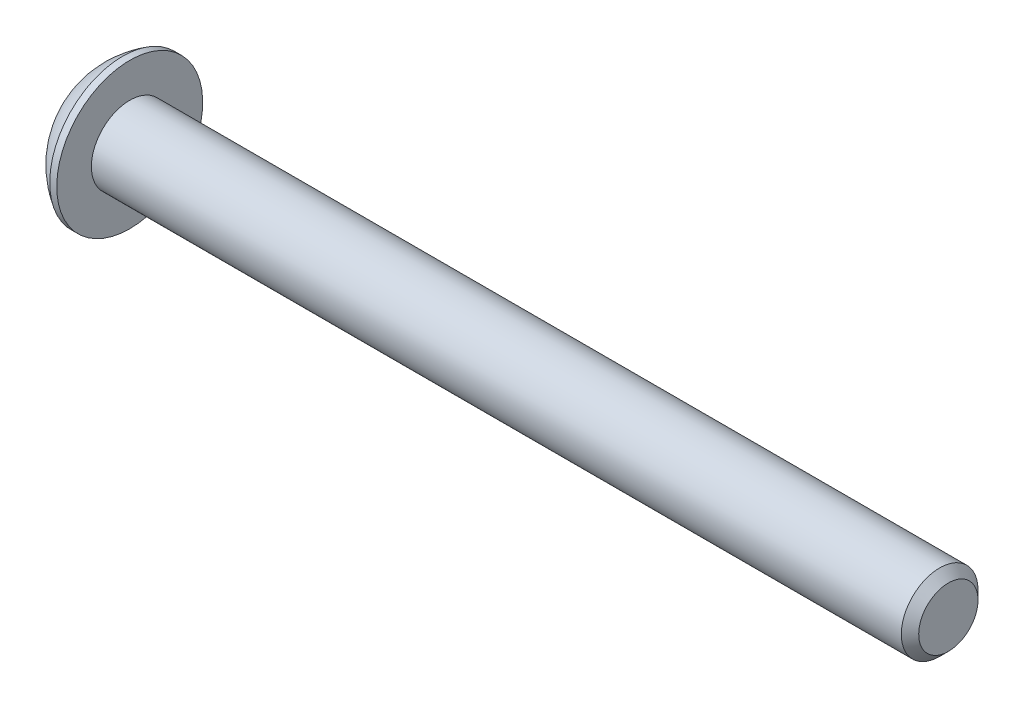
ISO-10303-21;
HEADER;
FILE_DESCRIPTION(('STEP AP214'),'2;1');
FILE_NAME('part.step','',(''),(''),'','','');
FILE_SCHEMA(('AUTOMOTIVE_DESIGN { 1 0 10303 214 1 1 1 1 }'));
ENDSEC;
DATA;
#1=APPLICATION_CONTEXT('core data for automotive mechanical design processes');
#2=APPLICATION_PROTOCOL_DEFINITION('international standard','automotive_design',2000,#1);
#3=PRODUCT_CONTEXT('',#1,'mechanical');
#4=PRODUCT('Part','Part','',(#3));
#5=PRODUCT_RELATED_PRODUCT_CATEGORY('part','',(#4));
#6=PRODUCT_DEFINITION_FORMATION('','',#4);
#7=PRODUCT_DEFINITION_CONTEXT('part definition',#1,'design');
#8=PRODUCT_DEFINITION('design','',#6,#7);
#9=PRODUCT_DEFINITION_SHAPE('','',#8);
#10=(LENGTH_UNIT() NAMED_UNIT(*) SI_UNIT(.MILLI.,.METRE.));
#11=(NAMED_UNIT(*) PLANE_ANGLE_UNIT() SI_UNIT($,.RADIAN.));
#12=(NAMED_UNIT(*) SI_UNIT($,.STERADIAN.) SOLID_ANGLE_UNIT());
#13=UNCERTAINTY_MEASURE_WITH_UNIT(LENGTH_MEASURE(1.E-05),#10,'distance_accuracy_value','');
#14=(GEOMETRIC_REPRESENTATION_CONTEXT(3) GLOBAL_UNCERTAINTY_ASSIGNED_CONTEXT((#13)) GLOBAL_UNIT_ASSIGNED_CONTEXT((#10,
#11,#12)) REPRESENTATION_CONTEXT('',''));
#15=CARTESIAN_POINT('',(0.,0.,0.));
#16=DIRECTION('',(0.,0.,1.));
#17=DIRECTION('',(1.,0.,0.));
#18=AXIS2_PLACEMENT_3D('',#15,#16,#17);
#19=CARTESIAN_POINT('',(1.32080000000623,1.51854885817992E-13,1.17961196366423E-13));
#20=DIRECTION('',(-1.,0.,0.));
#21=DIRECTION('',(0.,-1.,0.));
#22=AXIS2_PLACEMENT_3D('',#19,#20,#21);
#23=CONICAL_SURFACE('',#22,1.19380000000346,1.04719755119619);
#24=CARTESIAN_POINT('',(2.01004075136707,1.52655665886015E-13,6.66133814775094E-13));
#25=VERTEX_POINT('',#24);
#26=VERTEX_LOOP('',#25);
#27=FACE_BOUND('',#26,.T.);
#28=CARTESIAN_POINT('',(1.32080000000623,1.51854885817992E-13,1.17961196366423E-13));
#29=DIRECTION('',(-1.,0.,0.));
#30=DIRECTION('',(0.,-1.,0.));
#31=AXIS2_PLACEMENT_3D('',#28,#29,#30);
#32=CIRCLE('',#31,1.19380000000346);
#33=CARTESIAN_POINT('',(1.32080000000314,-1.03386112703932,0.596900000000856));
#34=VERTEX_POINT('',#33);
#35=CARTESIAN_POINT('',(1.32080000000313,1.62736157638526E-13,1.19380000000181));
#36=VERTEX_POINT('',#35);
#37=EDGE_CURVE('E20',#34,#36,#32,.T.);
#38=ORIENTED_EDGE('',*,*,#37,.T.);
#39=CARTESIAN_POINT('',(1.32080000000623,1.51854885817992E-13,1.17961196366423E-13));
#40=DIRECTION('',(-1.,0.,0.));
#41=DIRECTION('',(0.,-1.,0.));
#42=AXIS2_PLACEMENT_3D('',#39,#40,#41);
#43=CIRCLE('',#42,1.19380000000346);
#44=CARTESIAN_POINT('',(1.32080000000312,1.03386112703943,0.596900000001005));
#45=VERTEX_POINT('',#44);
#46=EDGE_CURVE('E148',#36,#45,#43,.T.);
#47=ORIENTED_EDGE('',*,*,#46,.T.);
#48=CARTESIAN_POINT('',(1.32080000000623,1.51854885817992E-13,1.17961196366423E-13));
#49=DIRECTION('',(-1.,0.,0.));
#50=DIRECTION('',(0.,-1.,0.));
#51=AXIS2_PLACEMENT_3D('',#48,#49,#50);
#52=CIRCLE('',#51,1.19380000000346);
#53=CARTESIAN_POINT('',(1.32080000000312,1.03386112703949,-0.596900000000715));
#54=VERTEX_POINT('',#53);
#55=EDGE_CURVE('E445',#45,#54,#52,.T.);
#56=ORIENTED_EDGE('',*,*,#55,.T.);
#57=CARTESIAN_POINT('',(1.32080000000623,1.51854885817992E-13,1.17961196366423E-13));
#58=DIRECTION('',(-1.,0.,0.));
#59=DIRECTION('',(0.,-1.,0.));
#60=AXIS2_PLACEMENT_3D('',#57,#58,#59);
#61=CIRCLE('',#60,1.19380000000346);
#62=CARTESIAN_POINT('',(1.32080000000312,0.,-1.19380000000181));
#63=VERTEX_POINT('',#62);
#64=EDGE_CURVE('E446',#54,#63,#61,.T.);
#65=ORIENTED_EDGE('',*,*,#64,.T.);
#66=CARTESIAN_POINT('',(1.32080000000623,1.51854885817992E-13,1.17961196366423E-13));
#67=DIRECTION('',(-1.,0.,0.));
#68=DIRECTION('',(0.,-1.,0.));
#69=AXIS2_PLACEMENT_3D('',#66,#67,#68);
#70=CIRCLE('',#69,1.19380000000346);
#71=CARTESIAN_POINT('',(1.32080000000315,-1.03386112703931,-0.596900000000785));
#72=VERTEX_POINT('',#71);
#73=EDGE_CURVE('E93',#63,#72,#70,.T.);
#74=ORIENTED_EDGE('',*,*,#73,.T.);
#75=CARTESIAN_POINT('',(1.32080000000623,1.51854885817992E-13,1.17961196366423E-13));
#76=DIRECTION('',(-1.,0.,0.));
#77=DIRECTION('',(0.,-1.,0.));
#78=AXIS2_PLACEMENT_3D('',#75,#76,#77);
#79=CIRCLE('',#78,1.19380000000346);
#80=EDGE_CURVE('E89',#72,#34,#79,.T.);
#81=ORIENTED_EDGE('',*,*,#80,.T.);
#82=EDGE_LOOP('',(#38,#47,#56,#65,#74,#81));
#83=FACE_BOUND('',#82,.T.);
#84=ADVANCED_FACE('F17',(#27,#83),#23,.F.);
#85=CARTESIAN_POINT('',(1.32080000000001,-2.06772225407575,-1.19379999999989));
#86=DIRECTION('',(1.,0.,0.));
#87=DIRECTION('',(0.,1.,0.));
#88=AXIS2_PLACEMENT_3D('',#85,#86,#87);
#89=PLANE('',#88);
#90=DIRECTION('',(0.,0.500000000000003,0.866025403784437));
#91=VECTOR('',#90,1.);
#92=CARTESIAN_POINT('',(1.32080000000002,-1.37848150271713,0.));
#93=LINE('',#92,#91);
#94=CARTESIAN_POINT('',(1.32080000000002,-0.689240751358549,1.19380000000004));
#95=VERTEX_POINT('',#94);
#96=EDGE_CURVE('E101',#95,#34,#93,.F.);
#97=ORIENTED_EDGE('',*,*,#96,.F.);
#98=DIRECTION('',(0.,1.,0.));
#99=VECTOR('',#98,1.);
#100=CARTESIAN_POINT('',(1.32080000000002,-0.689240751358539,1.19380000000003));
#101=LINE('',#100,#99);
#102=EDGE_CURVE('E103',#36,#95,#101,.F.);
#103=ORIENTED_EDGE('',*,*,#102,.F.);
#104=ORIENTED_EDGE('',*,*,#37,.F.);
#105=EDGE_LOOP('',(#97,#103,#104));
#106=FACE_BOUND('',#105,.T.);
#107=ADVANCED_FACE('F99',(#106),#89,.F.);
#108=CARTESIAN_POINT('',(1.32080000000001,-2.06772225407575,-1.19379999999989));
#109=DIRECTION('',(1.,0.,0.));
#110=DIRECTION('',(0.,1.,0.));
#111=AXIS2_PLACEMENT_3D('',#108,#109,#110);
#112=PLANE('',#111);
#113=DIRECTION('',(0.,-0.499999999999997,0.86602540378444));
#114=VECTOR('',#113,1.);
#115=CARTESIAN_POINT('',(1.32079999999996,-0.689240751358594,-1.19380000000002));
#116=LINE('',#115,#114);
#117=CARTESIAN_POINT('',(1.3208,-1.37848150271717,0.));
#118=VERTEX_POINT('',#117);
#119=EDGE_CURVE('E109',#118,#72,#116,.F.);
#120=ORIENTED_EDGE('',*,*,#119,.F.);
#121=DIRECTION('',(0.,0.500000000000003,0.866025403784437));
#122=VECTOR('',#121,1.);
#123=CARTESIAN_POINT('',(1.32080000000006,-1.37848150271713,0.));
#124=LINE('',#123,#122);
#125=EDGE_CURVE('E106',#34,#118,#124,.F.);
#126=ORIENTED_EDGE('',*,*,#125,.F.);
#127=ORIENTED_EDGE('',*,*,#80,.F.);
#128=EDGE_LOOP('',(#120,#126,#127));
#129=FACE_BOUND('',#128,.T.);
#130=ADVANCED_FACE('F107',(#129),#112,.F.);
#131=CARTESIAN_POINT('',(1.32080000000001,-2.06772225407575,-1.19379999999989));
#132=DIRECTION('',(1.,0.,0.));
#133=DIRECTION('',(0.,1.,0.));
#134=AXIS2_PLACEMENT_3D('',#131,#132,#133);
#135=PLANE('',#134);
#136=DIRECTION('',(0.,-1.,0.));
#137=VECTOR('',#136,1.);
#138=CARTESIAN_POINT('',(1.3208,0.689240751358677,-1.19379999999995));
#139=LINE('',#138,#137);
#140=CARTESIAN_POINT('',(1.32080000000002,-0.689240751358607,-1.19379999999996));
#141=VERTEX_POINT('',#140);
#142=EDGE_CURVE('E416',#141,#63,#139,.F.);
#143=ORIENTED_EDGE('',*,*,#142,.F.);
#144=DIRECTION('',(0.,-0.499999999999997,0.86602540378444));
#145=VECTOR('',#144,1.);
#146=CARTESIAN_POINT('',(1.32080000000006,-0.689240751358594,-1.19380000000002));
#147=LINE('',#146,#145);
#148=EDGE_CURVE('E428',#72,#141,#147,.F.);
#149=ORIENTED_EDGE('',*,*,#148,.F.);
#150=ORIENTED_EDGE('',*,*,#73,.F.);
#151=EDGE_LOOP('',(#143,#149,#150));
#152=FACE_BOUND('',#151,.T.);
#153=ADVANCED_FACE('F191',(#152),#135,.F.);
#154=CARTESIAN_POINT('',(1.32080000000001,-2.06772225407575,-1.19379999999989));
#155=DIRECTION('',(1.,0.,0.));
#156=DIRECTION('',(0.,1.,0.));
#157=AXIS2_PLACEMENT_3D('',#154,#155,#156);
#158=PLANE('',#157);
#159=DIRECTION('',(0.,-0.500000000000002,-0.866025403784438));
#160=VECTOR('',#159,1.);
#161=CARTESIAN_POINT('',(1.32080000000005,1.37848150271722,1.11022302462516E-13));
#162=LINE('',#161,#160);
#163=CARTESIAN_POINT('',(1.32080000000003,0.689240751358622,-1.19379999999993));
#164=VERTEX_POINT('',#163);
#165=EDGE_CURVE('E402',#164,#54,#162,.F.);
#166=ORIENTED_EDGE('',*,*,#165,.F.);
#167=DIRECTION('',(0.,-1.,0.));
#168=VECTOR('',#167,1.);
#169=CARTESIAN_POINT('',(1.32080000000002,0.689240751358677,-1.19379999999995));
#170=LINE('',#169,#168);
#171=EDGE_CURVE('E413',#63,#164,#170,.F.);
#172=ORIENTED_EDGE('',*,*,#171,.F.);
#173=ORIENTED_EDGE('',*,*,#64,.F.);
#174=EDGE_LOOP('',(#166,#172,#173));
#175=FACE_BOUND('',#174,.T.);
#176=ADVANCED_FACE('F187',(#175),#158,.F.);
#177=CARTESIAN_POINT('',(1.32080000000001,-2.06772225407575,-1.19379999999989));
#178=DIRECTION('',(1.,0.,0.));
#179=DIRECTION('',(0.,1.,0.));
#180=AXIS2_PLACEMENT_3D('',#177,#178,#179);
#181=PLANE('',#180);
#182=DIRECTION('',(0.,0.499999999999997,-0.866025403784441));
#183=VECTOR('',#182,1.);
#184=CARTESIAN_POINT('',(1.32079999999996,0.689240751358622,1.19380000000008));
#185=LINE('',#184,#183);
#186=CARTESIAN_POINT('',(1.32079999999999,1.37848150271721,0.));
#187=VERTEX_POINT('',#186);
#188=EDGE_CURVE('E381',#187,#45,#185,.F.);
#189=ORIENTED_EDGE('',*,*,#188,.F.);
#190=DIRECTION('',(0.,-0.500000000000002,-0.866025403784438));
#191=VECTOR('',#190,1.);
#192=CARTESIAN_POINT('',(1.32080000000002,1.37848150271722,1.11022302462516E-13));
#193=LINE('',#192,#191);
#194=EDGE_CURVE('E400',#54,#187,#193,.F.);
#195=ORIENTED_EDGE('',*,*,#194,.F.);
#196=ORIENTED_EDGE('',*,*,#55,.F.);
#197=EDGE_LOOP('',(#189,#195,#196));
#198=FACE_BOUND('',#197,.T.);
#199=ADVANCED_FACE('F183',(#198),#181,.F.);
#200=CARTESIAN_POINT('',(1.32080000000001,-2.06772225407575,-1.19379999999989));
#201=DIRECTION('',(1.,0.,0.));
#202=DIRECTION('',(0.,1.,0.));
#203=AXIS2_PLACEMENT_3D('',#200,#201,#202);
#204=PLANE('',#203);
#205=DIRECTION('',(0.,1.,0.));
#206=VECTOR('',#205,1.);
#207=CARTESIAN_POINT('',(1.32080000000006,-0.689240751358539,1.19380000000003));
#208=LINE('',#207,#206);
#209=CARTESIAN_POINT('',(1.32080000000003,0.689240751358618,1.19380000000007));
#210=VERTEX_POINT('',#209);
#211=EDGE_CURVE('E118',#210,#36,#208,.F.);
#212=ORIENTED_EDGE('',*,*,#211,.F.);
#213=DIRECTION('',(0.,0.499999999999997,-0.866025403784441));
#214=VECTOR('',#213,1.);
#215=CARTESIAN_POINT('',(1.32080000000002,0.689240751358622,1.19380000000008));
#216=LINE('',#215,#214);
#217=EDGE_CURVE('E384',#45,#210,#216,.F.);
#218=ORIENTED_EDGE('',*,*,#217,.F.);
#219=ORIENTED_EDGE('',*,*,#46,.F.);
#220=EDGE_LOOP('',(#212,#218,#219));
#221=FACE_BOUND('',#220,.T.);
#222=ADVANCED_FACE('F179',(#221),#204,.F.);
#223=CARTESIAN_POINT('',(1.32080000000002,-0.689240751358539,1.19380000000003));
#224=DIRECTION('',(0.,0.,-1.));
#225=DIRECTION('',(0.,1.,0.));
#226=AXIS2_PLACEMENT_3D('',#223,#224,#225);
#227=PLANE('',#226);
#228=DIRECTION('',(0.,-1.,0.));
#229=VECTOR('',#228,1.);
#230=CARTESIAN_POINT('',(0.,0.,1.19380000000011));
#231=LINE('',#230,#229);
#232=CARTESIAN_POINT('',(0.,0.689240751358518,1.19380000000007));
#233=VERTEX_POINT('',#232);
#234=CARTESIAN_POINT('',(0.,-0.689240751358539,1.19380000000005));
#235=VERTEX_POINT('',#234);
#236=EDGE_CURVE('E378',#233,#235,#231,.T.);
#237=ORIENTED_EDGE('',*,*,#236,.F.);
#238=DIRECTION('',(1.,0.,0.));
#239=VECTOR('',#238,1.);
#240=CARTESIAN_POINT('',(1.32080000000006,0.689240751358622,1.19380000000008));
#241=LINE('',#240,#239);
#242=EDGE_CURVE('E390',#210,#233,#241,.F.);
#243=ORIENTED_EDGE('',*,*,#242,.F.);
#244=ORIENTED_EDGE('',*,*,#211,.T.);
#245=ORIENTED_EDGE('',*,*,#102,.T.);
#246=DIRECTION('',(1.,0.,0.));
#247=VECTOR('',#246,1.);
#248=CARTESIAN_POINT('',(1.32079999999996,-0.689240751358554,1.19380000000004));
#249=LINE('',#248,#247);
#250=EDGE_CURVE('E112',#235,#95,#249,.T.);
#251=ORIENTED_EDGE('',*,*,#250,.F.);
#252=EDGE_LOOP('',(#237,#243,#244,#245,#251));
#253=FACE_BOUND('',#252,.T.);
#254=ADVANCED_FACE('F176',(#253),#227,.T.);
#255=CARTESIAN_POINT('',(1.32079999999996,-1.37848150271713,0.));
#256=DIRECTION('',(0.,0.866025403784437,-0.500000000000003));
#257=DIRECTION('',(0.,0.500000000000003,0.866025403784437));
#258=AXIS2_PLACEMENT_3D('',#255,#256,#257);
#259=PLANE('',#258);
#260=DIRECTION('',(0.,-0.499999999999991,-0.866025403784444));
#261=VECTOR('',#260,1.);
#262=CARTESIAN_POINT('',(0.,-0.689240751358566,1.19380000000004));
#263=LINE('',#262,#261);
#264=CARTESIAN_POINT('',(0.,-1.37848150271714,0.));
#265=VERTEX_POINT('',#264);
#266=EDGE_CURVE('E375',#235,#265,#263,.T.);
#267=ORIENTED_EDGE('',*,*,#266,.F.);
#268=ORIENTED_EDGE('',*,*,#250,.T.);
#269=ORIENTED_EDGE('',*,*,#96,.T.);
#270=ORIENTED_EDGE('',*,*,#125,.T.);
#271=DIRECTION('',(1.,0.,0.));
#272=VECTOR('',#271,1.);
#273=CARTESIAN_POINT('',(1.3208,-1.37848150271719,0.));
#274=LINE('',#273,#272);
#275=EDGE_CURVE('E425',#265,#118,#274,.T.);
#276=ORIENTED_EDGE('',*,*,#275,.F.);
#277=EDGE_LOOP('',(#267,#268,#269,#270,#276));
#278=FACE_BOUND('',#277,.T.);
#279=ADVANCED_FACE('F116',(#278),#259,.T.);
#280=CARTESIAN_POINT('',(1.3208,-0.689240751358594,-1.19380000000002));
#281=DIRECTION('',(0.,0.86602540378444,0.499999999999997));
#282=DIRECTION('',(0.,-0.499999999999997,0.86602540378444));
#283=AXIS2_PLACEMENT_3D('',#280,#281,#282);
#284=PLANE('',#283);
#285=DIRECTION('',(0.,0.499999999999986,-0.866025403784447));
#286=VECTOR('',#285,1.);
#287=CARTESIAN_POINT('',(0.,-1.37848150271712,0.));
#288=LINE('',#287,#286);
#289=CARTESIAN_POINT('',(0.,-0.689240751358601,-1.19379999999996));
#290=VERTEX_POINT('',#289);
#291=EDGE_CURVE('E372',#265,#290,#288,.T.);
#292=ORIENTED_EDGE('',*,*,#291,.F.);
#293=ORIENTED_EDGE('',*,*,#275,.T.);
#294=ORIENTED_EDGE('',*,*,#119,.T.);
#295=ORIENTED_EDGE('',*,*,#148,.T.);
#296=DIRECTION('',(1.,0.,0.));
#297=VECTOR('',#296,1.);
#298=CARTESIAN_POINT('',(1.32080000000005,-0.689240751358608,-1.19379999999994));
#299=LINE('',#298,#297);
#300=EDGE_CURVE('E410',#290,#141,#299,.T.);
#301=ORIENTED_EDGE('',*,*,#300,.F.);
#302=EDGE_LOOP('',(#292,#293,#294,#295,#301));
#303=FACE_BOUND('',#302,.T.);
#304=ADVANCED_FACE('F169',(#303),#284,.T.);
#305=CARTESIAN_POINT('',(1.32080000000005,0.689240751358677,-1.19379999999995));
#306=DIRECTION('',(0.,0.,1.));
#307=DIRECTION('',(0.,-1.,0.));
#308=AXIS2_PLACEMENT_3D('',#305,#306,#307);
#309=PLANE('',#308);
#310=DIRECTION('',(0.,-1.,0.));
#311=VECTOR('',#310,1.);
#312=CARTESIAN_POINT('',(0.,0.,-1.19379999999988));
#313=LINE('',#312,#311);
#314=CARTESIAN_POINT('',(0.,0.689240751358655,-1.19379999999992));
#315=VERTEX_POINT('',#314);
#316=EDGE_CURVE('E369',#290,#315,#313,.F.);
#317=ORIENTED_EDGE('',*,*,#316,.F.);
#318=ORIENTED_EDGE('',*,*,#300,.T.);
#319=ORIENTED_EDGE('',*,*,#142,.T.);
#320=ORIENTED_EDGE('',*,*,#171,.T.);
#321=DIRECTION('',(1.,0.,0.));
#322=VECTOR('',#321,1.);
#323=CARTESIAN_POINT('',(1.32079999999996,0.689240751358624,-1.19379999999991));
#324=LINE('',#323,#322);
#325=EDGE_CURVE('E385',#315,#164,#324,.T.);
#326=ORIENTED_EDGE('',*,*,#325,.F.);
#327=EDGE_LOOP('',(#317,#318,#319,#320,#326));
#328=FACE_BOUND('',#327,.T.);
#329=ADVANCED_FACE('F166',(#328),#309,.T.);
#330=CARTESIAN_POINT('',(1.32079999999996,1.37848150271722,1.11022302462516E-13));
#331=DIRECTION('',(0.,-0.866025403784438,0.500000000000002));
#332=DIRECTION('',(0.,-0.500000000000002,-0.866025403784438));
#333=AXIS2_PLACEMENT_3D('',#330,#331,#332);
#334=PLANE('',#333);
#335=DIRECTION('',(0.,0.5,0.866025403784438));
#336=VECTOR('',#335,1.);
#337=CARTESIAN_POINT('',(0.,0.689240751358622,-1.19379999999991));
#338=LINE('',#337,#336);
#339=CARTESIAN_POINT('',(0.,1.3784815027172,0.));
#340=VERTEX_POINT('',#339);
#341=EDGE_CURVE('E366',#315,#340,#338,.T.);
#342=ORIENTED_EDGE('',*,*,#341,.F.);
#343=ORIENTED_EDGE('',*,*,#325,.T.);
#344=ORIENTED_EDGE('',*,*,#165,.T.);
#345=ORIENTED_EDGE('',*,*,#194,.T.);
#346=DIRECTION('',(1.,0.,0.));
#347=VECTOR('',#346,1.);
#348=CARTESIAN_POINT('',(1.32080000000006,1.37848150271722,0.));
#349=LINE('',#348,#347);
#350=EDGE_CURVE('E35',#340,#187,#349,.T.);
#351=ORIENTED_EDGE('',*,*,#350,.F.);
#352=EDGE_LOOP('',(#342,#343,#344,#345,#351));
#353=FACE_BOUND('',#352,.T.);
#354=ADVANCED_FACE('F162',(#353),#334,.T.);
#355=CARTESIAN_POINT('',(1.32080000000006,0.689240751358622,1.19380000000008));
#356=DIRECTION('',(0.,-0.866025403784441,-0.499999999999997));
#357=DIRECTION('',(0.,0.499999999999997,-0.866025403784441));
#358=AXIS2_PLACEMENT_3D('',#355,#356,#357);
#359=PLANE('',#358);
#360=DIRECTION('',(0.,-0.500000000000013,0.866025403784431));
#361=VECTOR('',#360,1.);
#362=CARTESIAN_POINT('',(0.,1.37848150271715,0.));
#363=LINE('',#362,#361);
#364=EDGE_CURVE('E147',#340,#233,#363,.T.);
#365=ORIENTED_EDGE('',*,*,#364,.F.);
#366=ORIENTED_EDGE('',*,*,#350,.T.);
#367=ORIENTED_EDGE('',*,*,#188,.T.);
#368=ORIENTED_EDGE('',*,*,#217,.T.);
#369=ORIENTED_EDGE('',*,*,#242,.T.);
#370=EDGE_LOOP('',(#365,#366,#367,#368,#369));
#371=FACE_BOUND('',#370,.T.);
#372=ADVANCED_FACE('F158',(#371),#359,.T.);
#373=CARTESIAN_POINT('',(0.,0.,0.));
#374=DIRECTION('',(-1.,0.,0.));
#375=DIRECTION('',(0.,-1.,0.));
#376=AXIS2_PLACEMENT_3D('',#373,#374,#375);
#377=PLANE('',#376);
#378=ORIENTED_EDGE('',*,*,#341,.T.);
#379=ORIENTED_EDGE('',*,*,#364,.T.);
#380=ORIENTED_EDGE('',*,*,#236,.T.);
#381=ORIENTED_EDGE('',*,*,#266,.T.);
#382=ORIENTED_EDGE('',*,*,#291,.T.);
#383=ORIENTED_EDGE('',*,*,#316,.T.);
#384=EDGE_LOOP('',(#378,#379,#380,#381,#382,#383));
#385=FACE_BOUND('',#384,.T.);
#386=CARTESIAN_POINT('',(0.,1.98119999999993,0.));
#387=CARTESIAN_POINT('',(0.,1.98119966642983,0.0556258831179466));
#388=CARTESIAN_POINT('',(0.,1.97885520380435,0.11126198939861));
#389=CARTESIAN_POINT('',(0.,1.96949260169533,0.222149719830461));
#390=CARTESIAN_POINT('',(0.,1.96247308239598,0.277401225602899));
#391=CARTESIAN_POINT('',(0.,1.94379192841031,0.387209508139752));
#392=CARTESIAN_POINT('',(-1.87442111367553E-13,1.93212292489518,0.441765039546369));
#393=CARTESIAN_POINT('',(1.83091155067341E-13,1.90422331175307,0.549729449347497));
#394=CARTESIAN_POINT('',(6.89834242710438E-13,1.8879890003533,0.603137359208874));
#395=CARTESIAN_POINT('',(1.14891574619754E-12,1.83266214476492,0.760839131321832));
#396=CARTESIAN_POINT('',(0.,1.78690023648837,0.862876433575433));
#397=CARTESIAN_POINT('',(0.,1.67887358150658,1.05780719540872));
#398=CARTESIAN_POINT('',(9.5049143484427E-13,1.61660820745841,1.15070030720801));
#399=CARTESIAN_POINT('',(5.91535564811722E-13,1.51224157140973,1.28116890915698));
#400=CARTESIAN_POINT('',(1.60621720376555E-13,1.47559703943531,1.32320451127027));
#401=CARTESIAN_POINT('',(-1.63926891216808E-13,1.39893832619704,1.40400288695709));
#402=CARTESIAN_POINT('',(0.,1.3589274278469,1.44276877695455));
#403=CARTESIAN_POINT('',(1.11332136559816E-13,1.23416504602188,1.55382272417904));
#404=CARTESIAN_POINT('',(0.,1.1446612555985,1.6208952795211));
#405=CARTESIAN_POINT('',(0.,0.955712144178068,1.73902218081179));
#406=CARTESIAN_POINT('',(0.,0.856267198233469,1.79007713076007));
#407=CARTESIAN_POINT('',(0.,0.650206345910749,1.87477637530953));
#408=CARTESIAN_POINT('',(0.,0.54359051613476,1.90842085586266));
#409=CARTESIAN_POINT('',(0.,0.326226155291923,1.95733039300655));
#410=CARTESIAN_POINT('',(0.,0.215477602157834,1.97259535144286));
#411=CARTESIAN_POINT('',(0.,-0.00701040587554147,1.98431697865417));
#412=CARTESIAN_POINT('',(0.,-0.118749860774829,1.98077364742915));
#413=CARTESIAN_POINT('',(0.,-0.34005017835558,1.95497485623823));
#414=CARTESIAN_POINT('',(0.,-0.44961105266835,1.93271949620215));
#415=CARTESIAN_POINT('',(0.,-0.663431110729268,1.87014138774521));
#416=CARTESIAN_POINT('',(0.,-0.767690237838614,1.8298184463527));
#417=CARTESIAN_POINT('',(0.,-0.968005760719438,1.73219968377094));
#418=CARTESIAN_POINT('',(0.,-1.06406184698119,1.67490322251637));
#419=CARTESIAN_POINT('',(0.,-1.19980276751292,1.5775737120587));
#420=CARTESIAN_POINT('',(0.,-1.24366557129222,1.54322665019463));
#421=CARTESIAN_POINT('',(0.,-1.32838995706705,1.47093063174261));
#422=CARTESIAN_POINT('',(0.,-1.36924860178715,1.43297823102436));
#423=CARTESIAN_POINT('',(0.,-1.48674671849231,1.31419842051169));
#424=CARTESIAN_POINT('',(0.,-1.55842832343245,1.22836221289308));
#425=CARTESIAN_POINT('',(0.,-1.68633968564758,1.0458616827249));
#426=CARTESIAN_POINT('',(0.,-1.74257003024888,0.949197771949742));
#427=CARTESIAN_POINT('',(0.,-1.81416142504018,0.79818260029865));
#428=CARTESIAN_POINT('',(0.,-1.83591780585883,0.746776203847756));
#429=CARTESIAN_POINT('',(0.,-1.875007541811,0.6423410816886));
#430=CARTESIAN_POINT('',(0.,-1.89234447645412,0.589313708122811));
#431=CARTESIAN_POINT('',(0.,-1.92246053433562,0.482076273028359));
#432=CARTESIAN_POINT('',(0.,-1.93524685475125,0.427868224257474));
#433=CARTESIAN_POINT('',(0.,-1.95620937250501,0.318578151844576));
#434=CARTESIAN_POINT('',(0.,-1.96438692958155,0.263496390912836));
#435=CARTESIAN_POINT('',(0.,-1.97388528284661,0.173607715038523));
#436=CARTESIAN_POINT('',(0.,-1.97662743364434,0.138944718024964));
#437=CARTESIAN_POINT('',(0.,-1.98028489645291,0.0695224782566674));
#438=CARTESIAN_POINT('',(0.,-1.98120020846375,0.034763235501931));
#439=CARTESIAN_POINT('',(0.,-1.98119966642998,-0.055625883117975));
#440=CARTESIAN_POINT('',(0.,-1.97885520380449,-0.111261989398638));
#441=CARTESIAN_POINT('',(0.,-1.96949260169548,-0.222149719830489));
#442=CARTESIAN_POINT('',(0.,-1.96247308239612,-0.277401225602927));
#443=CARTESIAN_POINT('',(0.,-1.94379192841046,-0.38720950813978));
#444=CARTESIAN_POINT('',(-1.83478666686338E-13,-1.93212292489533,-0.441765039546397));
#445=CARTESIAN_POINT('',(1.88131255056224E-13,-1.90422331175322,-0.549729449347525));
#446=CARTESIAN_POINT('',(6.96289529621221E-13,-1.88798900035345,-0.603137359208901));
#447=CARTESIAN_POINT('',(1.15664377452155E-12,-1.83266214476507,-0.760839131321859));
#448=CARTESIAN_POINT('',(0.,-1.78690023648852,-0.862876433575459));
#449=CARTESIAN_POINT('',(0.,-1.67887358150673,-1.05780719540875));
#450=CARTESIAN_POINT('',(9.56135337364818E-13,-1.61660820745856,-1.15070030720803));
#451=CARTESIAN_POINT('',(5.9635337888824E-13,-1.51224157140988,-1.281168909157));
#452=CARTESIAN_POINT('',(1.6451149968167E-13,-1.47559703943546,-1.32320451127029));
#453=CARTESIAN_POINT('',(-1.60892851447218E-13,-1.3989383261972,-1.40400288695712));
#454=CARTESIAN_POINT('',(0.,-1.35892742784705,-1.44276877695458));
#455=CARTESIAN_POINT('',(1.14701688043361E-13,-1.23416504602203,-1.55382272417906));
#456=CARTESIAN_POINT('',(0.,-1.14466125559865,-1.62089527952113));
#457=CARTESIAN_POINT('',(0.,-0.955712144178217,-1.73902218081181));
#458=CARTESIAN_POINT('',(0.,-0.856267198233616,-1.79007713076009));
#459=CARTESIAN_POINT('',(0.,-0.650206345910898,-1.87477637530956));
#460=CARTESIAN_POINT('',(0.,-0.543590516134911,-1.90842085586269));
#461=CARTESIAN_POINT('',(0.,-0.326226155292075,-1.95733039300658));
#462=CARTESIAN_POINT('',(0.,-0.215477602157986,-1.97259535144289));
#463=CARTESIAN_POINT('',(0.,0.00701040587539088,-1.98431697865419));
#464=CARTESIAN_POINT('',(0.,0.118749860774678,-1.98077364742918));
#465=CARTESIAN_POINT('',(0.,0.34005017835543,-1.95497485623826));
#466=CARTESIAN_POINT('',(0.,0.449611052668201,-1.93271949620219));
#467=CARTESIAN_POINT('',(0.,0.663431110729119,-1.87014138774524));
#468=CARTESIAN_POINT('',(0.,0.767690237838464,-1.82981844635273));
#469=CARTESIAN_POINT('',(0.,0.968005760719288,-1.73219968377097));
#470=CARTESIAN_POINT('',(0.,1.06406184698104,-1.6749032225164));
#471=CARTESIAN_POINT('',(0.,1.19980276751277,-1.57757371205873));
#472=CARTESIAN_POINT('',(0.,1.24366557129207,-1.54322665019465));
#473=CARTESIAN_POINT('',(0.,1.3283899570669,-1.47093063174264));
#474=CARTESIAN_POINT('',(0.,1.369248601787,-1.43297823102439));
#475=CARTESIAN_POINT('',(0.,1.48674671849217,-1.31419842051173));
#476=CARTESIAN_POINT('',(0.,1.5584283234323,-1.22836221289311));
#477=CARTESIAN_POINT('',(0.,1.68633968564743,-1.04586168272492));
#478=CARTESIAN_POINT('',(0.,1.74257003024873,-0.949197771949769));
#479=CARTESIAN_POINT('',(0.,1.81416142504004,-0.798182600298679));
#480=CARTESIAN_POINT('',(0.,1.83591780585868,-0.746776203847786));
#481=CARTESIAN_POINT('',(0.,1.87500754181085,-0.64234108168863));
#482=CARTESIAN_POINT('',(0.,1.89234447645397,-0.589313708122841));
#483=CARTESIAN_POINT('',(0.,1.92246053433547,-0.482076273028388));
#484=CARTESIAN_POINT('',(0.,1.93524685475111,-0.427868224257503));
#485=CARTESIAN_POINT('',(0.,1.95620937250486,-0.318578151844604));
#486=CARTESIAN_POINT('',(0.,1.9643869295814,-0.263496390912864));
#487=CARTESIAN_POINT('',(0.,1.97388528284646,-0.173607715038551));
#488=CARTESIAN_POINT('',(0.,1.97662743364419,-0.138944718024991));
#489=CARTESIAN_POINT('',(0.,1.98028489645276,-0.0695224782566955));
#490=CARTESIAN_POINT('',(0.,1.9812002084636,-0.0347632355019593));
#491=CARTESIAN_POINT('',(0.,1.98119999999993,0.));
#492=B_SPLINE_CURVE_WITH_KNOTS('',3,(#386,#387,#388,#389,#390,#391,#392,#393,#394,#395,#396,
#397,#398,#399,#400,#401,#402,#403,#404,#405,#406,#407,#408,#409,#410,#411,#412,#413,#414,#415,
#416,#417,#418,#419,#420,#421,#422,#423,#424,#425,#426,#427,#428,#429,#430,#431,#432,#433,#434,
#435,#436,#437,#438,#439,#440,#441,#442,#443,#444,#445,#446,#447,#448,#449,#450,#451,#452,#453,
#454,#455,#456,#457,#458,#459,#460,#461,#462,#463,#464,#465,#466,#467,#468,#469,#470,#471,#472,
#473,#474,#475,#476,#477,#478,#479,#480,#481,#482,#483,#484,#485,#486,#487,#488,#489,#490,#491),
.UNSPECIFIED.,.T.,.F.,(4,2,2,2,2,2,2,2,2,2,2,2,2,2,2,2,2,2,2,2,2,2,2,2,2,2,2,2,2,2,2,2,2,2,2,2,
2,2,2,2,2,2,2,2,2,2,2,2,2,2,2,2,4),(0.,0.166845646007828,0.333740557374255,0.500901034367694,
0.668197445942388,1.00199278686282,1.33580081809886,1.50292354032982,1.6698851310853,
2.00370118900129,2.33750465770544,2.67130456115909,3.00510624723801,3.33890793331696,
3.67270783677065,4.00651130547476,4.34032736339026,4.50728895414554,4.67441167637632,
5.00821970761259,5.34201504853332,5.50931146010827,5.67647193710191,5.84336684846844,
6.0102124944764,6.11448220058334,6.21875190669028,6.38559755269811,6.55249246406454,
6.71965294105798,6.88694935263267,7.2207446935531,7.55455272478914,7.7216754470201,
7.88863703777558,8.22245309569158,8.55625656439572,8.89005646784937,9.22385815392829,
9.55765984000724,9.89145974346093,10.225263212165,10.5590792700805,10.7260408608358,
10.8931635830666,11.2269716143029,11.5607669552236,11.7280633667985,11.8952238437922,
12.0621187551587,12.2289644011667,12.3332341072736,12.4375038133806),.UNSPECIFIED.);
#493=CARTESIAN_POINT('',(0.,1.98119999999993,0.));
#494=VERTEX_POINT('',#493);
#495=EDGE_CURVE('E140',#494,#494,#492,.T.);
#496=ORIENTED_EDGE('',*,*,#495,.F.);
#497=EDGE_LOOP('',(#496));
#498=FACE_BOUND('',#497,.T.);
#499=ADVANCED_FACE('F154',(#385,#498),#377,.T.);
#500=CARTESIAN_POINT('',(4.13385,0.,0.));
#501=DIRECTION('',(0.,1.,0.));
#502=DIRECTION('',(1.,0.,0.));
#503=AXIS2_PLACEMENT_3D('',#500,#501,#502);
#504=SPHERICAL_SURFACE('',#503,4.58408870578439);
#505=CARTESIAN_POINT('',(1.8288,0.,0.));
#506=DIRECTION('',(-1.,0.,0.));
#507=DIRECTION('',(0.,-1.,0.));
#508=AXIS2_PLACEMENT_3D('',#505,#506,#507);
#509=CIRCLE('',#508,3.96240000000003);
#510=CARTESIAN_POINT('',(1.82880000000001,-3.96240000000003,0.));
#511=VERTEX_POINT('',#510);
#512=EDGE_CURVE('E137',#511,#511,#509,.F.);
#513=ORIENTED_EDGE('',*,*,#512,.F.);
#514=EDGE_LOOP('',(#513));
#515=FACE_BOUND('',#514,.T.);
#516=ORIENTED_EDGE('',*,*,#495,.T.);
#517=EDGE_LOOP('',(#516));
#518=FACE_BOUND('',#517,.T.);
#519=ADVANCED_FACE('F150',(#515,#518),#504,.T.);
#520=CARTESIAN_POINT('',(46.6598,0.,0.));
#521=DIRECTION('',(-1.,0.,0.));
#522=DIRECTION('',(0.,-1.,0.));
#523=AXIS2_PLACEMENT_3D('',#520,#521,#522);
#524=PLANE('',#523);
#525=CARTESIAN_POINT('',(46.6597999999863,0.,0.));
#526=DIRECTION('',(-1.,0.,0.));
#527=DIRECTION('',(0.,-1.,0.));
#528=AXIS2_PLACEMENT_3D('',#525,#526,#527);
#529=CIRCLE('',#528,1.61035999997241);
#530=CARTESIAN_POINT('',(46.6597999999863,-1.61035999997245,0.));
#531=VERTEX_POINT('',#530);
#532=EDGE_CURVE('E134',#531,#531,#529,.T.);
#533=ORIENTED_EDGE('',*,*,#532,.F.);
#534=EDGE_LOOP('',(#533));
#535=FACE_BOUND('',#534,.T.);
#536=ADVANCED_FACE('F221',(#535),#524,.F.);
#537=CARTESIAN_POINT('',(0.,0.,0.));
#538=DIRECTION('',(-1.,0.,0.));
#539=DIRECTION('',(0.,-1.,0.));
#540=AXIS2_PLACEMENT_3D('',#537,#538,#539);
#541=CYLINDRICAL_SURFACE('',#540,3.96240000000003);
#542=ORIENTED_EDGE('',*,*,#512,.T.);
#543=EDGE_LOOP('',(#542));
#544=FACE_BOUND('',#543,.T.);
#545=CARTESIAN_POINT('',(2.2098,0.,0.));
#546=DIRECTION('',(-1.,0.,0.));
#547=DIRECTION('',(0.,-1.,0.));
#548=AXIS2_PLACEMENT_3D('',#545,#546,#547);
#549=CIRCLE('',#548,3.96240000000003);
#550=CARTESIAN_POINT('',(2.20980000000001,-3.96240000000003,0.));
#551=VERTEX_POINT('',#550);
#552=EDGE_CURVE('E131',#551,#551,#549,.T.);
#553=ORIENTED_EDGE('',*,*,#552,.T.);
#554=EDGE_LOOP('',(#553));
#555=FACE_BOUND('',#554,.T.);
#556=ADVANCED_FACE('F218',(#544,#555),#541,.T.);
#557=CARTESIAN_POINT('',(46.1873599999194,0.,0.));
#558=DIRECTION('',(-1.,0.,0.));
#559=DIRECTION('',(0.,-1.,0.));
#560=AXIS2_PLACEMENT_3D('',#557,#558,#559);
#561=CONICAL_SURFACE('',#560,2.08279999998242,0.785398163337289);
#562=CARTESIAN_POINT('',(46.18736,0.,0.));
#563=DIRECTION('',(-1.,0.,0.));
#564=DIRECTION('',(0.,-1.,0.));
#565=AXIS2_PLACEMENT_3D('',#562,#563,#564);
#566=CIRCLE('',#565,2.08280000000002);
#567=CARTESIAN_POINT('',(46.18736,-2.08279999999997,0.));
#568=VERTEX_POINT('',#567);
#569=EDGE_CURVE('E26',#568,#568,#566,.T.);
#570=ORIENTED_EDGE('',*,*,#569,.F.);
#571=EDGE_LOOP('',(#570));
#572=FACE_BOUND('',#571,.T.);
#573=ORIENTED_EDGE('',*,*,#532,.T.);
#574=EDGE_LOOP('',(#573));
#575=FACE_BOUND('',#574,.T.);
#576=ADVANCED_FACE('F211',(#572,#575),#561,.T.);
#577=CARTESIAN_POINT('',(2.20980000000011,2.08279999999998,0.));
#578=DIRECTION('',(-1.,0.,0.));
#579=DIRECTION('',(0.,-1.,0.));
#580=AXIS2_PLACEMENT_3D('',#577,#578,#579);
#581=PLANE('',#580);
#582=CARTESIAN_POINT('',(2.2098,0.,0.));
#583=DIRECTION('',(-1.,0.,0.));
#584=DIRECTION('',(0.,-1.,0.));
#585=AXIS2_PLACEMENT_3D('',#582,#583,#584);
#586=CIRCLE('',#585,2.08280000000002);
#587=CARTESIAN_POINT('',(2.2098,-2.08280000000002,0.));
#588=VERTEX_POINT('',#587);
#589=EDGE_CURVE('E11',#588,#588,#586,.F.);
#590=ORIENTED_EDGE('',*,*,#589,.F.);
#591=EDGE_LOOP('',(#590));
#592=FACE_BOUND('',#591,.T.);
#593=ORIENTED_EDGE('',*,*,#552,.F.);
#594=EDGE_LOOP('',(#593));
#595=FACE_BOUND('',#594,.T.);
#596=ADVANCED_FACE('F205',(#592,#595),#581,.F.);
#597=CARTESIAN_POINT('',(0.,0.,0.));
#598=DIRECTION('',(-1.,0.,0.));
#599=DIRECTION('',(0.,-1.,0.));
#600=AXIS2_PLACEMENT_3D('',#597,#598,#599);
#601=CYLINDRICAL_SURFACE('',#600,2.08280000000002);
#602=ORIENTED_EDGE('',*,*,#589,.T.);
#603=EDGE_LOOP('',(#602));
#604=FACE_BOUND('',#603,.T.);
#605=ORIENTED_EDGE('',*,*,#569,.T.);
#606=EDGE_LOOP('',(#605));
#607=FACE_BOUND('',#606,.T.);
#608=ADVANCED_FACE('F203',(#604,#607),#601,.T.);
#609=CLOSED_SHELL('',(#84,#107,#130,#153,#176,#199,#222,#254,#279,#304,#329,#354,#372,#499,#519,
#536,#556,#576,#596,#608));
#610=MANIFOLD_SOLID_BREP('B1',#609);
#611=ADVANCED_BREP_SHAPE_REPRESENTATION('',(#18,#610),#14);
#612=SHAPE_DEFINITION_REPRESENTATION(#9,#611);
ENDSEC;
END-ISO-10303-21;
